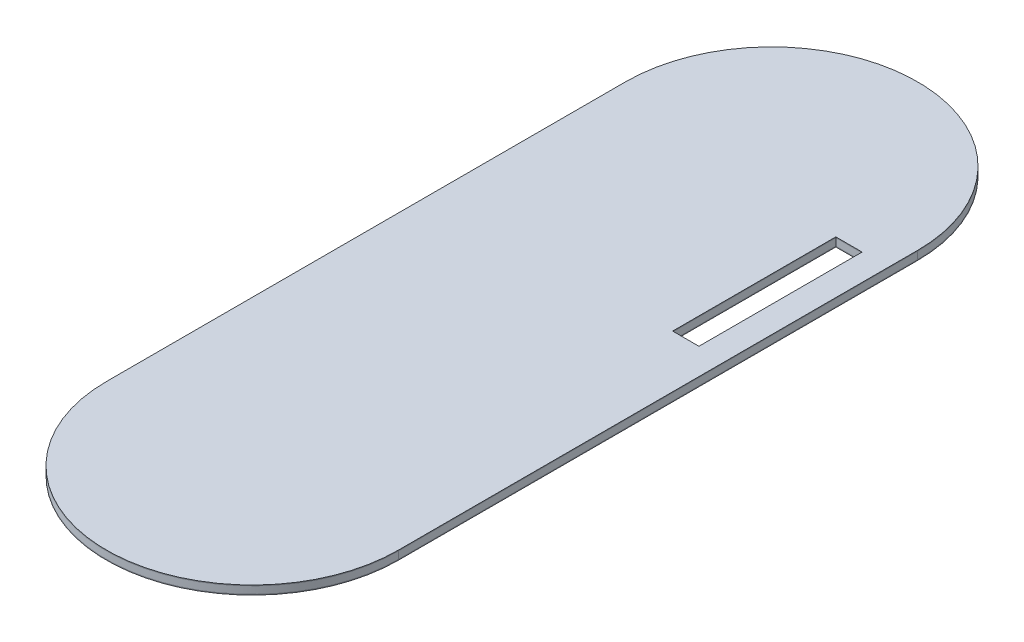
ISO-10303-21;
HEADER;
FILE_DESCRIPTION(('STEP AP214'),'2;1');
FILE_NAME('part.step','',(''),(''),'','','');
FILE_SCHEMA(('AUTOMOTIVE_DESIGN { 1 0 10303 214 1 1 1 1 }'));
ENDSEC;
DATA;
#1=APPLICATION_CONTEXT('core data for automotive mechanical design processes');
#2=APPLICATION_PROTOCOL_DEFINITION('international standard','automotive_design',2000,#1);
#3=PRODUCT_CONTEXT('',#1,'mechanical');
#4=PRODUCT('Part','Part','',(#3));
#5=PRODUCT_RELATED_PRODUCT_CATEGORY('part','',(#4));
#6=PRODUCT_DEFINITION_FORMATION('','',#4);
#7=PRODUCT_DEFINITION_CONTEXT('part definition',#1,'design');
#8=PRODUCT_DEFINITION('design','',#6,#7);
#9=PRODUCT_DEFINITION_SHAPE('','',#8);
#10=(LENGTH_UNIT() NAMED_UNIT(*) SI_UNIT(.MILLI.,.METRE.));
#11=(NAMED_UNIT(*) PLANE_ANGLE_UNIT() SI_UNIT($,.RADIAN.));
#12=(NAMED_UNIT(*) SI_UNIT($,.STERADIAN.) SOLID_ANGLE_UNIT());
#13=UNCERTAINTY_MEASURE_WITH_UNIT(LENGTH_MEASURE(1.E-05),#10,'distance_accuracy_value','');
#14=(GEOMETRIC_REPRESENTATION_CONTEXT(3) GLOBAL_UNCERTAINTY_ASSIGNED_CONTEXT((#13)) GLOBAL_UNIT_ASSIGNED_CONTEXT((#10,
#11,#12)) REPRESENTATION_CONTEXT('',''));
#15=CARTESIAN_POINT('',(0.,0.,0.));
#16=DIRECTION('',(0.,0.,1.));
#17=DIRECTION('',(1.,0.,0.));
#18=AXIS2_PLACEMENT_3D('',#15,#16,#17);
#19=CARTESIAN_POINT('',(0.,3.,-23.02));
#20=DIRECTION('',(0.,0.,1.));
#21=DIRECTION('',(1.,0.,0.));
#22=AXIS2_PLACEMENT_3D('',#19,#20,#21);
#23=PLANE('',#22);
#24=DIRECTION('',(-1.,0.,0.));
#25=VECTOR('',#24,1.);
#26=CARTESIAN_POINT('',(0.,2.75,-23.02));
#27=LINE('',#26,#25);
#28=CARTESIAN_POINT('',(41.,2.75,-23.02));
#29=VERTEX_POINT('',#28);
#30=CARTESIAN_POINT('',(32.,2.75,-23.02));
#31=VERTEX_POINT('',#30);
#32=EDGE_CURVE('E165',#29,#31,#27,.T.);
#33=ORIENTED_EDGE('',*,*,#32,.T.);
#34=DIRECTION('',(0.,-1.,0.));
#35=VECTOR('',#34,1.);
#36=CARTESIAN_POINT('',(32.,3.,-23.02));
#37=LINE('',#36,#35);
#38=CARTESIAN_POINT('',(32.,3.,-23.02));
#39=VERTEX_POINT('',#38);
#40=EDGE_CURVE('E12',#39,#31,#37,.T.);
#41=ORIENTED_EDGE('',*,*,#40,.F.);
#42=DIRECTION('',(-1.,0.,0.));
#43=VECTOR('',#42,1.);
#44=CARTESIAN_POINT('',(0.,3.,-23.02));
#45=LINE('',#44,#43);
#46=CARTESIAN_POINT('',(41.,3.,-23.02));
#47=VERTEX_POINT('',#46);
#48=EDGE_CURVE('E142',#47,#39,#45,.T.);
#49=ORIENTED_EDGE('',*,*,#48,.F.);
#50=DIRECTION('',(0.,-1.,0.));
#51=VECTOR('',#50,1.);
#52=CARTESIAN_POINT('',(41.,3.,-23.02));
#53=LINE('',#52,#51);
#54=EDGE_CURVE('E172',#47,#29,#53,.T.);
#55=ORIENTED_EDGE('',*,*,#54,.T.);
#56=EDGE_LOOP('',(#33,#41,#49,#55));
#57=FACE_BOUND('',#56,.T.);
#58=ADVANCED_FACE('F60',(#57),#23,.F.);
#59=CARTESIAN_POINT('',(32.,3.,0.));
#60=DIRECTION('',(-1.,0.,0.));
#61=DIRECTION('',(0.,0.,1.));
#62=AXIS2_PLACEMENT_3D('',#59,#60,#61);
#63=PLANE('',#62);
#64=DIRECTION('',(0.,0.,-1.));
#65=VECTOR('',#64,1.);
#66=CARTESIAN_POINT('',(32.,2.75,0.));
#67=LINE('',#66,#65);
#68=CARTESIAN_POINT('',(31.9999999999999,2.75,-78.9));
#69=VERTEX_POINT('',#68);
#70=EDGE_CURVE('E147',#31,#69,#67,.T.);
#71=ORIENTED_EDGE('',*,*,#70,.T.);
#72=DIRECTION('',(0.,-1.,0.));
#73=VECTOR('',#72,1.);
#74=CARTESIAN_POINT('',(31.9999999999999,3.,-78.9));
#75=LINE('',#74,#73);
#76=CARTESIAN_POINT('',(31.9999999999999,3.,-78.9));
#77=VERTEX_POINT('',#76);
#78=EDGE_CURVE('E70',#77,#69,#75,.T.);
#79=ORIENTED_EDGE('',*,*,#78,.F.);
#80=DIRECTION('',(0.,0.,-1.));
#81=VECTOR('',#80,1.);
#82=CARTESIAN_POINT('',(32.,3.,0.));
#83=LINE('',#82,#81);
#84=EDGE_CURVE('E136',#39,#77,#83,.T.);
#85=ORIENTED_EDGE('',*,*,#84,.F.);
#86=ORIENTED_EDGE('',*,*,#40,.T.);
#87=EDGE_LOOP('',(#71,#79,#85,#86));
#88=FACE_BOUND('',#87,.T.);
#89=ADVANCED_FACE('F146',(#88),#63,.F.);
#90=CARTESIAN_POINT('',(0.,3.,-78.9));
#91=DIRECTION('',(0.,0.,-1.));
#92=DIRECTION('',(-1.,0.,0.));
#93=AXIS2_PLACEMENT_3D('',#90,#91,#92);
#94=PLANE('',#93);
#95=DIRECTION('',(1.,0.,0.));
#96=VECTOR('',#95,1.);
#97=CARTESIAN_POINT('',(0.,2.75,-78.9));
#98=LINE('',#97,#96);
#99=CARTESIAN_POINT('',(41.,2.75,-78.9));
#100=VERTEX_POINT('',#99);
#101=EDGE_CURVE('E108',#69,#100,#98,.T.);
#102=ORIENTED_EDGE('',*,*,#101,.T.);
#103=DIRECTION('',(0.,-1.,0.));
#104=VECTOR('',#103,1.);
#105=CARTESIAN_POINT('',(41.,3.,-78.9));
#106=LINE('',#105,#104);
#107=CARTESIAN_POINT('',(41.,3.,-78.9));
#108=VERTEX_POINT('',#107);
#109=EDGE_CURVE('E148',#108,#100,#106,.T.);
#110=ORIENTED_EDGE('',*,*,#109,.F.);
#111=DIRECTION('',(1.,0.,0.));
#112=VECTOR('',#111,1.);
#113=CARTESIAN_POINT('',(0.,3.,-78.9));
#114=LINE('',#113,#112);
#115=EDGE_CURVE('E140',#77,#108,#114,.T.);
#116=ORIENTED_EDGE('',*,*,#115,.F.);
#117=ORIENTED_EDGE('',*,*,#78,.T.);
#118=EDGE_LOOP('',(#102,#110,#116,#117));
#119=FACE_BOUND('',#118,.T.);
#120=ADVANCED_FACE('F150',(#119),#94,.F.);
#121=CARTESIAN_POINT('',(0.,3.,88.9));
#122=DIRECTION('',(0.,-1.,0.));
#123=DIRECTION('',(0.,0.,-1.));
#124=AXIS2_PLACEMENT_3D('',#121,#122,#123);
#125=CYLINDRICAL_SURFACE('',#124,50.);
#126=CARTESIAN_POINT('',(0.,2.75,88.9));
#127=DIRECTION('',(0.,1.,0.));
#128=DIRECTION('',(0.,0.,1.));
#129=AXIS2_PLACEMENT_3D('',#126,#127,#128);
#130=CIRCLE('',#129,50.);
#131=CARTESIAN_POINT('',(-50.,2.75,88.9));
#132=VERTEX_POINT('',#131);
#133=CARTESIAN_POINT('',(50.,2.75,88.9));
#134=VERTEX_POINT('',#133);
#135=EDGE_CURVE('E156',#132,#134,#130,.T.);
#136=ORIENTED_EDGE('',*,*,#135,.T.);
#137=DIRECTION('',(0.,-1.,0.));
#138=VECTOR('',#137,1.);
#139=CARTESIAN_POINT('',(50.,3.,88.9));
#140=LINE('',#139,#138);
#141=CARTESIAN_POINT('',(50.,3.,88.9));
#142=VERTEX_POINT('',#141);
#143=EDGE_CURVE('E64',#142,#134,#140,.T.);
#144=ORIENTED_EDGE('',*,*,#143,.F.);
#145=CARTESIAN_POINT('',(0.,3.,88.9));
#146=DIRECTION('',(0.,1.,0.));
#147=DIRECTION('',(0.,0.,1.));
#148=AXIS2_PLACEMENT_3D('',#145,#146,#147);
#149=CIRCLE('',#148,50.);
#150=CARTESIAN_POINT('',(-50.,3.,88.9));
#151=VERTEX_POINT('',#150);
#152=EDGE_CURVE('E171',#151,#142,#149,.T.);
#153=ORIENTED_EDGE('',*,*,#152,.F.);
#154=DIRECTION('',(0.,-1.,0.));
#155=VECTOR('',#154,1.);
#156=CARTESIAN_POINT('',(-50.,3.,88.9));
#157=LINE('',#156,#155);
#158=EDGE_CURVE('E152',#151,#132,#157,.T.);
#159=ORIENTED_EDGE('',*,*,#158,.T.);
#160=EDGE_LOOP('',(#136,#144,#153,#159));
#161=FACE_BOUND('',#160,.T.);
#162=ADVANCED_FACE('F62',(#161),#125,.T.);
#163=CARTESIAN_POINT('',(50.,3.,0.));
#164=DIRECTION('',(-1.,0.,0.));
#165=DIRECTION('',(0.,0.,1.));
#166=AXIS2_PLACEMENT_3D('',#163,#164,#165);
#167=PLANE('',#166);
#168=DIRECTION('',(0.,0.,-1.));
#169=VECTOR('',#168,1.);
#170=CARTESIAN_POINT('',(50.,2.75,0.));
#171=LINE('',#170,#169);
#172=CARTESIAN_POINT('',(50.,2.75,-88.9));
#173=VERTEX_POINT('',#172);
#174=EDGE_CURVE('E159',#134,#173,#171,.T.);
#175=ORIENTED_EDGE('',*,*,#174,.T.);
#176=DIRECTION('',(0.,-1.,0.));
#177=VECTOR('',#176,1.);
#178=CARTESIAN_POINT('',(50.,3.,-88.9));
#179=LINE('',#178,#177);
#180=CARTESIAN_POINT('',(50.,3.,-88.9));
#181=VERTEX_POINT('',#180);
#182=EDGE_CURVE('E179',#181,#173,#179,.T.);
#183=ORIENTED_EDGE('',*,*,#182,.F.);
#184=DIRECTION('',(0.,0.,-1.));
#185=VECTOR('',#184,1.);
#186=CARTESIAN_POINT('',(50.,3.,0.));
#187=LINE('',#186,#185);
#188=EDGE_CURVE('E123',#142,#181,#187,.T.);
#189=ORIENTED_EDGE('',*,*,#188,.F.);
#190=ORIENTED_EDGE('',*,*,#143,.T.);
#191=EDGE_LOOP('',(#175,#183,#189,#190));
#192=FACE_BOUND('',#191,.T.);
#193=ADVANCED_FACE('F185',(#192),#167,.F.);
#194=CARTESIAN_POINT('',(0.,3.,-88.9));
#195=DIRECTION('',(0.,-1.,0.));
#196=DIRECTION('',(0.,0.,-1.));
#197=AXIS2_PLACEMENT_3D('',#194,#195,#196);
#198=CYLINDRICAL_SURFACE('',#197,50.);
#199=CARTESIAN_POINT('',(0.,2.75,-88.9));
#200=DIRECTION('',(0.,1.,0.));
#201=DIRECTION('',(0.,0.,1.));
#202=AXIS2_PLACEMENT_3D('',#199,#200,#201);
#203=CIRCLE('',#202,50.);
#204=CARTESIAN_POINT('',(-50.,2.75,-88.9));
#205=VERTEX_POINT('',#204);
#206=EDGE_CURVE('E161',#173,#205,#203,.T.);
#207=ORIENTED_EDGE('',*,*,#206,.T.);
#208=DIRECTION('',(0.,-1.,0.));
#209=VECTOR('',#208,1.);
#210=CARTESIAN_POINT('',(-50.,3.,-88.9));
#211=LINE('',#210,#209);
#212=CARTESIAN_POINT('',(-50.,3.,-88.9));
#213=VERTEX_POINT('',#212);
#214=EDGE_CURVE('E177',#213,#205,#211,.T.);
#215=ORIENTED_EDGE('',*,*,#214,.F.);
#216=CARTESIAN_POINT('',(0.,3.,-88.9));
#217=DIRECTION('',(0.,1.,0.));
#218=DIRECTION('',(0.,0.,1.));
#219=AXIS2_PLACEMENT_3D('',#216,#217,#218);
#220=CIRCLE('',#219,50.);
#221=EDGE_CURVE('E201',#181,#213,#220,.T.);
#222=ORIENTED_EDGE('',*,*,#221,.F.);
#223=ORIENTED_EDGE('',*,*,#182,.T.);
#224=EDGE_LOOP('',(#207,#215,#222,#223));
#225=FACE_BOUND('',#224,.T.);
#226=ADVANCED_FACE('F195',(#225),#198,.T.);
#227=CARTESIAN_POINT('',(-50.,3.,0.));
#228=DIRECTION('',(1.,0.,0.));
#229=DIRECTION('',(0.,0.,-1.));
#230=AXIS2_PLACEMENT_3D('',#227,#228,#229);
#231=PLANE('',#230);
#232=DIRECTION('',(0.,0.,1.));
#233=VECTOR('',#232,1.);
#234=CARTESIAN_POINT('',(-50.,2.75,0.));
#235=LINE('',#234,#233);
#236=EDGE_CURVE('E163',#205,#132,#235,.T.);
#237=ORIENTED_EDGE('',*,*,#236,.T.);
#238=ORIENTED_EDGE('',*,*,#158,.F.);
#239=DIRECTION('',(0.,0.,1.));
#240=VECTOR('',#239,1.);
#241=CARTESIAN_POINT('',(-50.,3.,0.));
#242=LINE('',#241,#240);
#243=EDGE_CURVE('E199',#213,#151,#242,.T.);
#244=ORIENTED_EDGE('',*,*,#243,.F.);
#245=ORIENTED_EDGE('',*,*,#214,.T.);
#246=EDGE_LOOP('',(#237,#238,#244,#245));
#247=FACE_BOUND('',#246,.T.);
#248=ADVANCED_FACE('F198',(#247),#231,.F.);
#249=CARTESIAN_POINT('',(41.,3.,0.));
#250=DIRECTION('',(1.,0.,0.));
#251=DIRECTION('',(0.,0.,-1.));
#252=AXIS2_PLACEMENT_3D('',#249,#250,#251);
#253=PLANE('',#252);
#254=DIRECTION('',(0.,0.,1.));
#255=VECTOR('',#254,1.);
#256=CARTESIAN_POINT('',(41.,2.75,0.));
#257=LINE('',#256,#255);
#258=EDGE_CURVE('E114',#100,#29,#257,.T.);
#259=ORIENTED_EDGE('',*,*,#258,.T.);
#260=ORIENTED_EDGE('',*,*,#54,.F.);
#261=DIRECTION('',(0.,0.,1.));
#262=VECTOR('',#261,1.);
#263=CARTESIAN_POINT('',(41.,3.,0.));
#264=LINE('',#263,#262);
#265=EDGE_CURVE('E79',#108,#47,#264,.T.);
#266=ORIENTED_EDGE('',*,*,#265,.F.);
#267=ORIENTED_EDGE('',*,*,#109,.T.);
#268=EDGE_LOOP('',(#259,#260,#266,#267));
#269=FACE_BOUND('',#268,.T.);
#270=ADVANCED_FACE('F207',(#269),#253,.F.);
#271=CARTESIAN_POINT('',(0.,3.,0.));
#272=DIRECTION('',(0.,1.,0.));
#273=DIRECTION('',(0.,0.,1.));
#274=AXIS2_PLACEMENT_3D('',#271,#272,#273);
#275=PLANE('',#274);
#276=ORIENTED_EDGE('',*,*,#152,.T.);
#277=ORIENTED_EDGE('',*,*,#188,.T.);
#278=ORIENTED_EDGE('',*,*,#221,.T.);
#279=ORIENTED_EDGE('',*,*,#243,.T.);
#280=EDGE_LOOP('',(#276,#277,#278,#279));
#281=FACE_BOUND('',#280,.T.);
#282=ORIENTED_EDGE('',*,*,#48,.T.);
#283=ORIENTED_EDGE('',*,*,#84,.T.);
#284=ORIENTED_EDGE('',*,*,#115,.T.);
#285=ORIENTED_EDGE('',*,*,#265,.T.);
#286=EDGE_LOOP('',(#282,#283,#284,#285));
#287=FACE_BOUND('',#286,.T.);
#288=ADVANCED_FACE('F138',(#281,#287),#275,.T.);
#289=CARTESIAN_POINT('',(0.,2.75,0.));
#290=DIRECTION('',(0.,1.,0.));
#291=DIRECTION('',(0.,0.,1.));
#292=AXIS2_PLACEMENT_3D('',#289,#290,#291);
#293=PLANE('',#292);
#294=ORIENTED_EDGE('',*,*,#135,.F.);
#295=ORIENTED_EDGE('',*,*,#236,.F.);
#296=ORIENTED_EDGE('',*,*,#206,.F.);
#297=ORIENTED_EDGE('',*,*,#174,.F.);
#298=EDGE_LOOP('',(#294,#295,#296,#297));
#299=FACE_BOUND('',#298,.T.);
#300=ORIENTED_EDGE('',*,*,#32,.F.);
#301=ORIENTED_EDGE('',*,*,#258,.F.);
#302=ORIENTED_EDGE('',*,*,#101,.F.);
#303=ORIENTED_EDGE('',*,*,#70,.F.);
#304=EDGE_LOOP('',(#300,#301,#302,#303));
#305=FACE_BOUND('',#304,.T.);
#306=ADVANCED_FACE('F192',(#299,#305),#293,.F.);
#307=CLOSED_SHELL('',(#58,#89,#120,#162,#193,#226,#248,#270,#288,#306));
#308=MANIFOLD_SOLID_BREP('B2',#307);
#309=CARTESIAN_POINT('',(50.,2.75,0.));
#310=DIRECTION('',(-1.,0.,0.));
#311=DIRECTION('',(0.,0.,1.));
#312=AXIS2_PLACEMENT_3D('',#309,#310,#311);
#313=PLANE('',#312);
#314=DIRECTION('',(0.,0.,-1.));
#315=VECTOR('',#314,1.);
#316=CARTESIAN_POINT('',(50.,0.25,0.));
#317=LINE('',#316,#315);
#318=CARTESIAN_POINT('',(50.,0.25,88.9));
#319=VERTEX_POINT('',#318);
#320=CARTESIAN_POINT('',(50.,0.25,-88.9));
#321=VERTEX_POINT('',#320);
#322=EDGE_CURVE('E425',#319,#321,#317,.T.);
#323=ORIENTED_EDGE('',*,*,#322,.T.);
#324=DIRECTION('',(0.,-1.,0.));
#325=VECTOR('',#324,1.);
#326=CARTESIAN_POINT('',(50.,2.75,-88.9));
#327=LINE('',#326,#325);
#328=CARTESIAN_POINT('',(50.,2.75,-88.9));
#329=VERTEX_POINT('',#328);
#330=EDGE_CURVE('E58',#329,#321,#327,.T.);
#331=ORIENTED_EDGE('',*,*,#330,.F.);
#332=DIRECTION('',(0.,0.,-1.));
#333=VECTOR('',#332,1.);
#334=CARTESIAN_POINT('',(50.,2.75,0.));
#335=LINE('',#334,#333);
#336=CARTESIAN_POINT('',(50.,2.75,88.9));
#337=VERTEX_POINT('',#336);
#338=EDGE_CURVE('E394',#337,#329,#335,.T.);
#339=ORIENTED_EDGE('',*,*,#338,.F.);
#340=DIRECTION('',(0.,-1.,0.));
#341=VECTOR('',#340,1.);
#342=CARTESIAN_POINT('',(50.,2.75,88.9));
#343=LINE('',#342,#341);
#344=EDGE_CURVE('E436',#337,#319,#343,.T.);
#345=ORIENTED_EDGE('',*,*,#344,.T.);
#346=EDGE_LOOP('',(#323,#331,#339,#345));
#347=FACE_BOUND('',#346,.T.);
#348=ADVANCED_FACE('F311',(#347),#313,.F.);
#349=CARTESIAN_POINT('',(0.,2.75,-88.9));
#350=DIRECTION('',(0.,-1.,0.));
#351=DIRECTION('',(0.,0.,-1.));
#352=AXIS2_PLACEMENT_3D('',#349,#350,#351);
#353=CYLINDRICAL_SURFACE('',#352,50.);
#354=CARTESIAN_POINT('',(0.,0.25,-88.9));
#355=DIRECTION('',(0.,1.,0.));
#356=DIRECTION('',(0.,0.,1.));
#357=AXIS2_PLACEMENT_3D('',#354,#355,#356);
#358=CIRCLE('',#357,50.);
#359=CARTESIAN_POINT('',(-50.,0.25,-88.9));
#360=VERTEX_POINT('',#359);
#361=EDGE_CURVE('E400',#321,#360,#358,.T.);
#362=ORIENTED_EDGE('',*,*,#361,.T.);
#363=DIRECTION('',(0.,-1.,0.));
#364=VECTOR('',#363,1.);
#365=CARTESIAN_POINT('',(-50.,2.75,-88.9));
#366=LINE('',#365,#364);
#367=CARTESIAN_POINT('',(-50.,2.75,-88.9));
#368=VERTEX_POINT('',#367);
#369=EDGE_CURVE('E322',#368,#360,#366,.T.);
#370=ORIENTED_EDGE('',*,*,#369,.F.);
#371=CARTESIAN_POINT('',(0.,2.75,-88.9));
#372=DIRECTION('',(0.,1.,0.));
#373=DIRECTION('',(0.,0.,1.));
#374=AXIS2_PLACEMENT_3D('',#371,#372,#373);
#375=CIRCLE('',#374,50.);
#376=EDGE_CURVE('E388',#329,#368,#375,.T.);
#377=ORIENTED_EDGE('',*,*,#376,.F.);
#378=ORIENTED_EDGE('',*,*,#330,.T.);
#379=EDGE_LOOP('',(#362,#370,#377,#378));
#380=FACE_BOUND('',#379,.T.);
#381=ADVANCED_FACE('F399',(#380),#353,.T.);
#382=CARTESIAN_POINT('',(-50.,2.75,0.));
#383=DIRECTION('',(1.,0.,0.));
#384=DIRECTION('',(0.,0.,-1.));
#385=AXIS2_PLACEMENT_3D('',#382,#383,#384);
#386=PLANE('',#385);
#387=DIRECTION('',(0.,0.,1.));
#388=VECTOR('',#387,1.);
#389=CARTESIAN_POINT('',(-50.,0.25,0.));
#390=LINE('',#389,#388);
#391=CARTESIAN_POINT('',(-50.,0.25,88.9));
#392=VERTEX_POINT('',#391);
#393=EDGE_CURVE('E360',#360,#392,#390,.T.);
#394=ORIENTED_EDGE('',*,*,#393,.T.);
#395=DIRECTION('',(0.,-1.,0.));
#396=VECTOR('',#395,1.);
#397=CARTESIAN_POINT('',(-50.,2.75,88.9));
#398=LINE('',#397,#396);
#399=CARTESIAN_POINT('',(-50.,2.75,88.9));
#400=VERTEX_POINT('',#399);
#401=EDGE_CURVE('E402',#400,#392,#398,.T.);
#402=ORIENTED_EDGE('',*,*,#401,.F.);
#403=DIRECTION('',(0.,0.,1.));
#404=VECTOR('',#403,1.);
#405=CARTESIAN_POINT('',(-50.,2.75,0.));
#406=LINE('',#405,#404);
#407=EDGE_CURVE('E392',#368,#400,#406,.T.);
#408=ORIENTED_EDGE('',*,*,#407,.F.);
#409=ORIENTED_EDGE('',*,*,#369,.T.);
#410=EDGE_LOOP('',(#394,#402,#408,#409));
#411=FACE_BOUND('',#410,.T.);
#412=ADVANCED_FACE('F404',(#411),#386,.F.);
#413=CARTESIAN_POINT('',(32.,2.75,0.));
#414=DIRECTION('',(-1.,0.,0.));
#415=DIRECTION('',(0.,0.,1.));
#416=AXIS2_PLACEMENT_3D('',#413,#414,#415);
#417=PLANE('',#416);
#418=DIRECTION('',(0.,0.,-1.));
#419=VECTOR('',#418,1.);
#420=CARTESIAN_POINT('',(32.,0.25,0.));
#421=LINE('',#420,#419);
#422=CARTESIAN_POINT('',(32.,0.25,-23.02));
#423=VERTEX_POINT('',#422);
#424=CARTESIAN_POINT('',(31.9999999999999,0.25,-78.9));
#425=VERTEX_POINT('',#424);
#426=EDGE_CURVE('E412',#423,#425,#421,.T.);
#427=ORIENTED_EDGE('',*,*,#426,.T.);
#428=DIRECTION('',(0.,-1.,0.));
#429=VECTOR('',#428,1.);
#430=CARTESIAN_POINT('',(31.9999999999999,2.75,-78.9));
#431=LINE('',#430,#429);
#432=CARTESIAN_POINT('',(31.9999999999999,2.75,-78.9));
#433=VERTEX_POINT('',#432);
#434=EDGE_CURVE('E315',#433,#425,#431,.T.);
#435=ORIENTED_EDGE('',*,*,#434,.F.);
#436=DIRECTION('',(0.,0.,-1.));
#437=VECTOR('',#436,1.);
#438=CARTESIAN_POINT('',(32.,2.75,0.));
#439=LINE('',#438,#437);
#440=CARTESIAN_POINT('',(32.,2.75,-23.02));
#441=VERTEX_POINT('',#440);
#442=EDGE_CURVE('E435',#441,#433,#439,.T.);
#443=ORIENTED_EDGE('',*,*,#442,.F.);
#444=DIRECTION('',(0.,-1.,0.));
#445=VECTOR('',#444,1.);
#446=CARTESIAN_POINT('',(32.,2.75,-23.02));
#447=LINE('',#446,#445);
#448=EDGE_CURVE('E408',#441,#423,#447,.T.);
#449=ORIENTED_EDGE('',*,*,#448,.T.);
#450=EDGE_LOOP('',(#427,#435,#443,#449));
#451=FACE_BOUND('',#450,.T.);
#452=ADVANCED_FACE('F313',(#451),#417,.F.);
#453=CARTESIAN_POINT('',(0.,2.75,-78.9));
#454=DIRECTION('',(0.,0.,-1.));
#455=DIRECTION('',(-1.,0.,0.));
#456=AXIS2_PLACEMENT_3D('',#453,#454,#455);
#457=PLANE('',#456);
#458=DIRECTION('',(1.,0.,0.));
#459=VECTOR('',#458,1.);
#460=CARTESIAN_POINT('',(0.,0.25,-78.9));
#461=LINE('',#460,#459);
#462=CARTESIAN_POINT('',(41.,0.25,-78.9));
#463=VERTEX_POINT('',#462);
#464=EDGE_CURVE('E416',#425,#463,#461,.T.);
#465=ORIENTED_EDGE('',*,*,#464,.T.);
#466=DIRECTION('',(0.,-1.,0.));
#467=VECTOR('',#466,1.);
#468=CARTESIAN_POINT('',(41.,2.75,-78.9));
#469=LINE('',#468,#467);
#470=CARTESIAN_POINT('',(41.,2.75,-78.9));
#471=VERTEX_POINT('',#470);
#472=EDGE_CURVE('E447',#471,#463,#469,.T.);
#473=ORIENTED_EDGE('',*,*,#472,.F.);
#474=DIRECTION('',(1.,0.,0.));
#475=VECTOR('',#474,1.);
#476=CARTESIAN_POINT('',(0.,2.75,-78.9));
#477=LINE('',#476,#475);
#478=EDGE_CURVE('E375',#433,#471,#477,.T.);
#479=ORIENTED_EDGE('',*,*,#478,.F.);
#480=ORIENTED_EDGE('',*,*,#434,.T.);
#481=EDGE_LOOP('',(#465,#473,#479,#480));
#482=FACE_BOUND('',#481,.T.);
#483=ADVANCED_FACE('F455',(#482),#457,.F.);
#484=CARTESIAN_POINT('',(41.,2.75,0.));
#485=DIRECTION('',(1.,0.,0.));
#486=DIRECTION('',(0.,0.,-1.));
#487=AXIS2_PLACEMENT_3D('',#484,#485,#486);
#488=PLANE('',#487);
#489=DIRECTION('',(0.,0.,1.));
#490=VECTOR('',#489,1.);
#491=CARTESIAN_POINT('',(41.,0.25,0.));
#492=LINE('',#491,#490);
#493=CARTESIAN_POINT('',(41.,0.25,-23.02));
#494=VERTEX_POINT('',#493);
#495=EDGE_CURVE('E419',#463,#494,#492,.T.);
#496=ORIENTED_EDGE('',*,*,#495,.T.);
#497=DIRECTION('',(0.,-1.,0.));
#498=VECTOR('',#497,1.);
#499=CARTESIAN_POINT('',(41.,2.75,-23.02));
#500=LINE('',#499,#498);
#501=CARTESIAN_POINT('',(41.,2.75,-23.02));
#502=VERTEX_POINT('',#501);
#503=EDGE_CURVE('E444',#502,#494,#500,.T.);
#504=ORIENTED_EDGE('',*,*,#503,.F.);
#505=DIRECTION('',(0.,0.,1.));
#506=VECTOR('',#505,1.);
#507=CARTESIAN_POINT('',(41.,2.75,0.));
#508=LINE('',#507,#506);
#509=EDGE_CURVE('E472',#471,#502,#508,.T.);
#510=ORIENTED_EDGE('',*,*,#509,.F.);
#511=ORIENTED_EDGE('',*,*,#472,.T.);
#512=EDGE_LOOP('',(#496,#504,#510,#511));
#513=FACE_BOUND('',#512,.T.);
#514=ADVANCED_FACE('F465',(#513),#488,.F.);
#515=CARTESIAN_POINT('',(0.,2.75,-23.02));
#516=DIRECTION('',(0.,0.,1.));
#517=DIRECTION('',(1.,0.,0.));
#518=AXIS2_PLACEMENT_3D('',#515,#516,#517);
#519=PLANE('',#518);
#520=DIRECTION('',(-1.,0.,0.));
#521=VECTOR('',#520,1.);
#522=CARTESIAN_POINT('',(0.,0.25,-23.02));
#523=LINE('',#522,#521);
#524=EDGE_CURVE('E422',#494,#423,#523,.T.);
#525=ORIENTED_EDGE('',*,*,#524,.T.);
#526=ORIENTED_EDGE('',*,*,#448,.F.);
#527=DIRECTION('',(-1.,0.,0.));
#528=VECTOR('',#527,1.);
#529=CARTESIAN_POINT('',(0.,2.75,-23.02));
#530=LINE('',#529,#528);
#531=EDGE_CURVE('E469',#502,#441,#530,.T.);
#532=ORIENTED_EDGE('',*,*,#531,.F.);
#533=ORIENTED_EDGE('',*,*,#503,.T.);
#534=EDGE_LOOP('',(#525,#526,#532,#533));
#535=FACE_BOUND('',#534,.T.);
#536=ADVANCED_FACE('F468',(#535),#519,.F.);
#537=CARTESIAN_POINT('',(0.,2.75,88.9));
#538=DIRECTION('',(0.,-1.,0.));
#539=DIRECTION('',(0.,0.,-1.));
#540=AXIS2_PLACEMENT_3D('',#537,#538,#539);
#541=CYLINDRICAL_SURFACE('',#540,50.);
#542=CARTESIAN_POINT('',(0.,0.25,88.9));
#543=DIRECTION('',(0.,1.,0.));
#544=DIRECTION('',(0.,0.,1.));
#545=AXIS2_PLACEMENT_3D('',#542,#543,#544);
#546=CIRCLE('',#545,50.);
#547=EDGE_CURVE('E366',#392,#319,#546,.T.);
#548=ORIENTED_EDGE('',*,*,#547,.T.);
#549=ORIENTED_EDGE('',*,*,#344,.F.);
#550=CARTESIAN_POINT('',(0.,2.75,88.9));
#551=DIRECTION('',(0.,1.,0.));
#552=DIRECTION('',(0.,0.,1.));
#553=AXIS2_PLACEMENT_3D('',#550,#551,#552);
#554=CIRCLE('',#553,50.);
#555=EDGE_CURVE('E331',#400,#337,#554,.T.);
#556=ORIENTED_EDGE('',*,*,#555,.F.);
#557=ORIENTED_EDGE('',*,*,#401,.T.);
#558=EDGE_LOOP('',(#548,#549,#556,#557));
#559=FACE_BOUND('',#558,.T.);
#560=ADVANCED_FACE('F482',(#559),#541,.T.);
#561=CARTESIAN_POINT('',(0.,2.75,0.));
#562=DIRECTION('',(0.,1.,0.));
#563=DIRECTION('',(0.,0.,1.));
#564=AXIS2_PLACEMENT_3D('',#561,#562,#563);
#565=PLANE('',#564);
#566=ORIENTED_EDGE('',*,*,#442,.T.);
#567=ORIENTED_EDGE('',*,*,#478,.T.);
#568=ORIENTED_EDGE('',*,*,#509,.T.);
#569=ORIENTED_EDGE('',*,*,#531,.T.);
#570=EDGE_LOOP('',(#566,#567,#568,#569));
#571=FACE_BOUND('',#570,.T.);
#572=ORIENTED_EDGE('',*,*,#338,.T.);
#573=ORIENTED_EDGE('',*,*,#376,.T.);
#574=ORIENTED_EDGE('',*,*,#407,.T.);
#575=ORIENTED_EDGE('',*,*,#555,.T.);
#576=EDGE_LOOP('',(#572,#573,#574,#575));
#577=FACE_BOUND('',#576,.T.);
#578=ADVANCED_FACE('F390',(#571,#577),#565,.T.);
#579=CARTESIAN_POINT('',(0.,0.25,0.));
#580=DIRECTION('',(0.,1.,0.));
#581=DIRECTION('',(0.,0.,1.));
#582=AXIS2_PLACEMENT_3D('',#579,#580,#581);
#583=PLANE('',#582);
#584=ORIENTED_EDGE('',*,*,#426,.F.);
#585=ORIENTED_EDGE('',*,*,#524,.F.);
#586=ORIENTED_EDGE('',*,*,#495,.F.);
#587=ORIENTED_EDGE('',*,*,#464,.F.);
#588=EDGE_LOOP('',(#584,#585,#586,#587));
#589=FACE_BOUND('',#588,.T.);
#590=ORIENTED_EDGE('',*,*,#322,.F.);
#591=ORIENTED_EDGE('',*,*,#547,.F.);
#592=ORIENTED_EDGE('',*,*,#393,.F.);
#593=ORIENTED_EDGE('',*,*,#361,.F.);
#594=EDGE_LOOP('',(#590,#591,#592,#593));
#595=FACE_BOUND('',#594,.T.);
#596=ADVANCED_FACE('F462',(#589,#595),#583,.F.);
#597=CLOSED_SHELL('',(#348,#381,#412,#452,#483,#514,#536,#560,#578,#596));
#598=MANIFOLD_SOLID_BREP('B6',#597);
#599=CARTESIAN_POINT('',(0.,0.25,-88.9));
#600=DIRECTION('',(0.,1.,0.));
#601=DIRECTION('',(0.,0.,1.));
#602=AXIS2_PLACEMENT_3D('',#599,#600,#601);
#603=PLANE('',#602);
#604=CARTESIAN_POINT('',(0.,0.25,-88.9));
#605=DIRECTION('',(0.,1.,0.));
#606=DIRECTION('',(0.,0.,1.));
#607=AXIS2_PLACEMENT_3D('',#604,#605,#606);
#608=CIRCLE('',#607,50.);
#609=CARTESIAN_POINT('',(50.,0.25,-88.9));
#610=VERTEX_POINT('',#609);
#611=CARTESIAN_POINT('',(-50.,0.25,-88.9));
#612=VERTEX_POINT('',#611);
#613=EDGE_CURVE('E690',#610,#612,#608,.T.);
#614=ORIENTED_EDGE('',*,*,#613,.T.);
#615=DIRECTION('',(0.,0.,1.));
#616=VECTOR('',#615,1.);
#617=CARTESIAN_POINT('',(-50.,0.25,-88.9));
#618=LINE('',#617,#616);
#619=CARTESIAN_POINT('',(-50.,0.25,88.9));
#620=VERTEX_POINT('',#619);
#621=EDGE_CURVE('E693',#612,#620,#618,.T.);
#622=ORIENTED_EDGE('',*,*,#621,.T.);
#623=CARTESIAN_POINT('',(0.,0.25,88.9));
#624=DIRECTION('',(0.,1.,0.));
#625=DIRECTION('',(0.,0.,1.));
#626=AXIS2_PLACEMENT_3D('',#623,#624,#625);
#627=CIRCLE('',#626,50.);
#628=CARTESIAN_POINT('',(50.,0.25,88.9));
#629=VERTEX_POINT('',#628);
#630=EDGE_CURVE('E696',#620,#629,#627,.T.);
#631=ORIENTED_EDGE('',*,*,#630,.T.);
#632=DIRECTION('',(0.,0.,-1.));
#633=VECTOR('',#632,1.);
#634=CARTESIAN_POINT('',(50.,0.25,-88.9));
#635=LINE('',#634,#633);
#636=EDGE_CURVE('E698',#629,#610,#635,.T.);
#637=ORIENTED_EDGE('',*,*,#636,.T.);
#638=EDGE_LOOP('',(#614,#622,#631,#637));
#639=FACE_BOUND('',#638,.T.);
#640=DIRECTION('',(-1.,0.,0.));
#641=VECTOR('',#640,1.);
#642=CARTESIAN_POINT('',(31.9999999999999,0.25,-78.9));
#643=LINE('',#642,#641);
#644=CARTESIAN_POINT('',(41.,0.25,-78.9));
#645=VERTEX_POINT('',#644);
#646=CARTESIAN_POINT('',(31.9999999999999,0.25,-78.9));
#647=VERTEX_POINT('',#646);
#648=EDGE_CURVE('E662',#645,#647,#643,.T.);
#649=ORIENTED_EDGE('',*,*,#648,.F.);
#650=DIRECTION('',(0.,0.,-1.));
#651=VECTOR('',#650,1.);
#652=CARTESIAN_POINT('',(41.,0.25,-78.9));
#653=LINE('',#652,#651);
#654=CARTESIAN_POINT('',(41.,0.25,-23.02));
#655=VERTEX_POINT('',#654);
#656=EDGE_CURVE('E654',#655,#645,#653,.T.);
#657=ORIENTED_EDGE('',*,*,#656,.F.);
#658=DIRECTION('',(1.,0.,0.));
#659=VECTOR('',#658,1.);
#660=CARTESIAN_POINT('',(41.,0.25,-23.02));
#661=LINE('',#660,#659);
#662=CARTESIAN_POINT('',(32.,0.25,-23.02));
#663=VERTEX_POINT('',#662);
#664=EDGE_CURVE('E676',#663,#655,#661,.T.);
#665=ORIENTED_EDGE('',*,*,#664,.F.);
#666=DIRECTION('',(0.,0.,1.));
#667=VECTOR('',#666,1.);
#668=CARTESIAN_POINT('',(32.,0.25,-23.02));
#669=LINE('',#668,#667);
#670=EDGE_CURVE('E674',#647,#663,#669,.T.);
#671=ORIENTED_EDGE('',*,*,#670,.F.);
#672=EDGE_LOOP('',(#649,#657,#665,#671));
#673=FACE_BOUND('',#672,.T.);
#674=ADVANCED_FACE('F589',(#639,#673),#603,.T.);
#675=CARTESIAN_POINT('',(0.,0.,-88.9));
#676=DIRECTION('',(0.,1.,0.));
#677=DIRECTION('',(0.,0.,1.));
#678=AXIS2_PLACEMENT_3D('',#675,#676,#677);
#679=PLANE('',#678);
#680=CARTESIAN_POINT('',(0.,0.,-88.9));
#681=DIRECTION('',(0.,1.,0.));
#682=DIRECTION('',(0.,0.,1.));
#683=AXIS2_PLACEMENT_3D('',#680,#681,#682);
#684=CIRCLE('',#683,50.);
#685=CARTESIAN_POINT('',(50.,0.,-88.9));
#686=VERTEX_POINT('',#685);
#687=CARTESIAN_POINT('',(-50.,0.,-88.9));
#688=VERTEX_POINT('',#687);
#689=EDGE_CURVE('E670',#686,#688,#684,.T.);
#690=ORIENTED_EDGE('',*,*,#689,.F.);
#691=DIRECTION('',(0.,0.,-1.));
#692=VECTOR('',#691,1.);
#693=CARTESIAN_POINT('',(50.,0.,-88.9));
#694=LINE('',#693,#692);
#695=CARTESIAN_POINT('',(50.,0.,88.9));
#696=VERTEX_POINT('',#695);
#697=EDGE_CURVE('E694',#696,#686,#694,.T.);
#698=ORIENTED_EDGE('',*,*,#697,.F.);
#699=CARTESIAN_POINT('',(0.,0.,88.9));
#700=DIRECTION('',(0.,1.,0.));
#701=DIRECTION('',(0.,0.,1.));
#702=AXIS2_PLACEMENT_3D('',#699,#700,#701);
#703=CIRCLE('',#702,50.);
#704=CARTESIAN_POINT('',(-50.,0.,88.9));
#705=VERTEX_POINT('',#704);
#706=EDGE_CURVE('E705',#705,#696,#703,.T.);
#707=ORIENTED_EDGE('',*,*,#706,.F.);
#708=DIRECTION('',(0.,0.,1.));
#709=VECTOR('',#708,1.);
#710=CARTESIAN_POINT('',(-50.,0.,-88.9));
#711=LINE('',#710,#709);
#712=EDGE_CURVE('E703',#688,#705,#711,.T.);
#713=ORIENTED_EDGE('',*,*,#712,.F.);
#714=EDGE_LOOP('',(#690,#698,#707,#713));
#715=FACE_BOUND('',#714,.T.);
#716=DIRECTION('',(0.,0.,-1.));
#717=VECTOR('',#716,1.);
#718=CARTESIAN_POINT('',(41.,0.,-78.9));
#719=LINE('',#718,#717);
#720=CARTESIAN_POINT('',(41.,0.,-23.02));
#721=VERTEX_POINT('',#720);
#722=CARTESIAN_POINT('',(41.,0.,-78.9));
#723=VERTEX_POINT('',#722);
#724=EDGE_CURVE('E612',#721,#723,#719,.T.);
#725=ORIENTED_EDGE('',*,*,#724,.T.);
#726=DIRECTION('',(-1.,0.,0.));
#727=VECTOR('',#726,1.);
#728=CARTESIAN_POINT('',(31.9999999999999,0.,-78.9));
#729=LINE('',#728,#727);
#730=CARTESIAN_POINT('',(31.9999999999999,0.,-78.9));
#731=VERTEX_POINT('',#730);
#732=EDGE_CURVE('E669',#723,#731,#729,.T.);
#733=ORIENTED_EDGE('',*,*,#732,.T.);
#734=DIRECTION('',(0.,0.,1.));
#735=VECTOR('',#734,1.);
#736=CARTESIAN_POINT('',(32.,0.,-23.02));
#737=LINE('',#736,#735);
#738=CARTESIAN_POINT('',(32.,0.,-23.02));
#739=VERTEX_POINT('',#738);
#740=EDGE_CURVE('E682',#731,#739,#737,.T.);
#741=ORIENTED_EDGE('',*,*,#740,.T.);
#742=DIRECTION('',(1.,0.,0.));
#743=VECTOR('',#742,1.);
#744=CARTESIAN_POINT('',(41.,0.,-23.02));
#745=LINE('',#744,#743);
#746=EDGE_CURVE('E663',#739,#721,#745,.T.);
#747=ORIENTED_EDGE('',*,*,#746,.T.);
#748=EDGE_LOOP('',(#725,#733,#741,#747));
#749=FACE_BOUND('',#748,.T.);
#750=ADVANCED_FACE('F723',(#715,#749),#679,.F.);
#751=CARTESIAN_POINT('',(0.,0.25,-88.9));
#752=DIRECTION('',(0.,-1.,0.));
#753=DIRECTION('',(0.,0.,-1.));
#754=AXIS2_PLACEMENT_3D('',#751,#752,#753);
#755=CYLINDRICAL_SURFACE('',#754,50.);
#756=ORIENTED_EDGE('',*,*,#689,.T.);
#757=DIRECTION('',(0.,-1.,0.));
#758=VECTOR('',#757,1.);
#759=CARTESIAN_POINT('',(-50.,0.25,-88.9));
#760=LINE('',#759,#758);
#761=EDGE_CURVE('E309',#612,#688,#760,.T.);
#762=ORIENTED_EDGE('',*,*,#761,.F.);
#763=ORIENTED_EDGE('',*,*,#613,.F.);
#764=DIRECTION('',(0.,-1.,0.));
#765=VECTOR('',#764,1.);
#766=CARTESIAN_POINT('',(50.,0.25,-88.9));
#767=LINE('',#766,#765);
#768=EDGE_CURVE('E700',#610,#686,#767,.T.);
#769=ORIENTED_EDGE('',*,*,#768,.T.);
#770=EDGE_LOOP('',(#756,#762,#763,#769));
#771=FACE_BOUND('',#770,.T.);
#772=ADVANCED_FACE('F591',(#771),#755,.T.);
#773=CARTESIAN_POINT('',(-50.,0.25,-88.9));
#774=DIRECTION('',(1.,0.,0.));
#775=DIRECTION('',(0.,0.,-1.));
#776=AXIS2_PLACEMENT_3D('',#773,#774,#775);
#777=PLANE('',#776);
#778=ORIENTED_EDGE('',*,*,#712,.T.);
#779=DIRECTION('',(0.,-1.,0.));
#780=VECTOR('',#779,1.);
#781=CARTESIAN_POINT('',(-50.,0.25,88.9));
#782=LINE('',#781,#780);
#783=EDGE_CURVE('E597',#620,#705,#782,.T.);
#784=ORIENTED_EDGE('',*,*,#783,.F.);
#785=ORIENTED_EDGE('',*,*,#621,.F.);
#786=ORIENTED_EDGE('',*,*,#761,.T.);
#787=EDGE_LOOP('',(#778,#784,#785,#786));
#788=FACE_BOUND('',#787,.T.);
#789=ADVANCED_FACE('F733',(#788),#777,.F.);
#790=CARTESIAN_POINT('',(0.,0.25,88.9));
#791=DIRECTION('',(0.,-1.,0.));
#792=DIRECTION('',(0.,0.,-1.));
#793=AXIS2_PLACEMENT_3D('',#790,#791,#792);
#794=CYLINDRICAL_SURFACE('',#793,50.);
#795=ORIENTED_EDGE('',*,*,#706,.T.);
#796=DIRECTION('',(0.,-1.,0.));
#797=VECTOR('',#796,1.);
#798=CARTESIAN_POINT('',(50.,0.25,88.9));
#799=LINE('',#798,#797);
#800=EDGE_CURVE('E710',#629,#696,#799,.T.);
#801=ORIENTED_EDGE('',*,*,#800,.F.);
#802=ORIENTED_EDGE('',*,*,#630,.F.);
#803=ORIENTED_EDGE('',*,*,#783,.T.);
#804=EDGE_LOOP('',(#795,#801,#802,#803));
#805=FACE_BOUND('',#804,.T.);
#806=ADVANCED_FACE('F717',(#805),#794,.T.);
#807=CARTESIAN_POINT('',(50.,0.25,-88.9));
#808=DIRECTION('',(-1.,0.,0.));
#809=DIRECTION('',(0.,0.,1.));
#810=AXIS2_PLACEMENT_3D('',#807,#808,#809);
#811=PLANE('',#810);
#812=ORIENTED_EDGE('',*,*,#697,.T.);
#813=ORIENTED_EDGE('',*,*,#768,.F.);
#814=ORIENTED_EDGE('',*,*,#636,.F.);
#815=ORIENTED_EDGE('',*,*,#800,.T.);
#816=EDGE_LOOP('',(#812,#813,#814,#815));
#817=FACE_BOUND('',#816,.T.);
#818=ADVANCED_FACE('F727',(#817),#811,.F.);
#819=CARTESIAN_POINT('',(41.,0.25,-78.9));
#820=DIRECTION('',(-1.,0.,0.));
#821=DIRECTION('',(0.,0.,1.));
#822=AXIS2_PLACEMENT_3D('',#819,#820,#821);
#823=PLANE('',#822);
#824=ORIENTED_EDGE('',*,*,#724,.F.);
#825=DIRECTION('',(0.,-1.,0.));
#826=VECTOR('',#825,1.);
#827=CARTESIAN_POINT('',(41.,0.25,-23.02));
#828=LINE('',#827,#826);
#829=EDGE_CURVE('E658',#655,#721,#828,.T.);
#830=ORIENTED_EDGE('',*,*,#829,.F.);
#831=ORIENTED_EDGE('',*,*,#656,.T.);
#832=DIRECTION('',(0.,-1.,0.));
#833=VECTOR('',#832,1.);
#834=CARTESIAN_POINT('',(41.,0.25,-78.9));
#835=LINE('',#834,#833);
#836=EDGE_CURVE('E657',#645,#723,#835,.T.);
#837=ORIENTED_EDGE('',*,*,#836,.T.);
#838=EDGE_LOOP('',(#824,#830,#831,#837));
#839=FACE_BOUND('',#838,.T.);
#840=ADVANCED_FACE('F656',(#839),#823,.T.);
#841=CARTESIAN_POINT('',(31.9999999999999,0.25,-78.9));
#842=DIRECTION('',(0.,0.,1.));
#843=DIRECTION('',(1.,0.,0.));
#844=AXIS2_PLACEMENT_3D('',#841,#842,#843);
#845=PLANE('',#844);
#846=ORIENTED_EDGE('',*,*,#732,.F.);
#847=ORIENTED_EDGE('',*,*,#836,.F.);
#848=ORIENTED_EDGE('',*,*,#648,.T.);
#849=DIRECTION('',(0.,-1.,0.));
#850=VECTOR('',#849,1.);
#851=CARTESIAN_POINT('',(31.9999999999999,0.25,-78.9));
#852=LINE('',#851,#850);
#853=EDGE_CURVE('E671',#647,#731,#852,.T.);
#854=ORIENTED_EDGE('',*,*,#853,.T.);
#855=EDGE_LOOP('',(#846,#847,#848,#854));
#856=FACE_BOUND('',#855,.T.);
#857=ADVANCED_FACE('F666',(#856),#845,.T.);
#858=CARTESIAN_POINT('',(32.,0.25,-23.02));
#859=DIRECTION('',(1.,0.,0.));
#860=DIRECTION('',(0.,0.,-1.));
#861=AXIS2_PLACEMENT_3D('',#858,#859,#860);
#862=PLANE('',#861);
#863=ORIENTED_EDGE('',*,*,#740,.F.);
#864=ORIENTED_EDGE('',*,*,#853,.F.);
#865=ORIENTED_EDGE('',*,*,#670,.T.);
#866=DIRECTION('',(0.,-1.,0.));
#867=VECTOR('',#866,1.);
#868=CARTESIAN_POINT('',(32.,0.25,-23.02));
#869=LINE('',#868,#867);
#870=EDGE_CURVE('E604',#663,#739,#869,.T.);
#871=ORIENTED_EDGE('',*,*,#870,.T.);
#872=EDGE_LOOP('',(#863,#864,#865,#871));
#873=FACE_BOUND('',#872,.T.);
#874=ADVANCED_FACE('F756',(#873),#862,.T.);
#875=CARTESIAN_POINT('',(41.,0.25,-23.02));
#876=DIRECTION('',(0.,0.,-1.));
#877=DIRECTION('',(-1.,0.,0.));
#878=AXIS2_PLACEMENT_3D('',#875,#876,#877);
#879=PLANE('',#878);
#880=ORIENTED_EDGE('',*,*,#746,.F.);
#881=ORIENTED_EDGE('',*,*,#870,.F.);
#882=ORIENTED_EDGE('',*,*,#664,.T.);
#883=ORIENTED_EDGE('',*,*,#829,.T.);
#884=EDGE_LOOP('',(#880,#881,#882,#883));
#885=FACE_BOUND('',#884,.T.);
#886=ADVANCED_FACE('F760',(#885),#879,.T.);
#887=CLOSED_SHELL('',(#674,#750,#772,#789,#806,#818,#840,#857,#874,#886));
#888=MANIFOLD_SOLID_BREP('B52',#887);
#889=ADVANCED_BREP_SHAPE_REPRESENTATION('',(#18,#308,#598,#888),#14);
#890=SHAPE_DEFINITION_REPRESENTATION(#9,#889);
ENDSEC;
END-ISO-10303-21;
